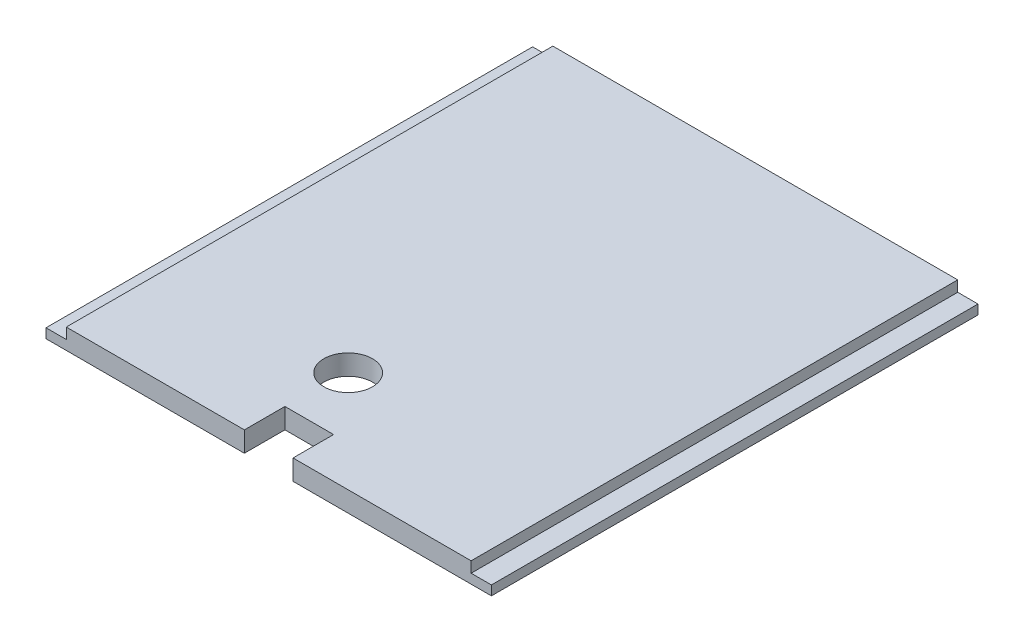
ISO-10303-21;
HEADER;
FILE_DESCRIPTION(('STEP AP214'),'2;1');
FILE_NAME('part.step','',(''),(''),'','','');
FILE_SCHEMA(('AUTOMOTIVE_DESIGN { 1 0 10303 214 1 1 1 1 }'));
ENDSEC;
DATA;
#1=APPLICATION_CONTEXT('core data for automotive mechanical design processes');
#2=APPLICATION_PROTOCOL_DEFINITION('international standard','automotive_design',2000,#1);
#3=PRODUCT_CONTEXT('',#1,'mechanical');
#4=PRODUCT('Part','Part','',(#3));
#5=PRODUCT_RELATED_PRODUCT_CATEGORY('part','',(#4));
#6=PRODUCT_DEFINITION_FORMATION('','',#4);
#7=PRODUCT_DEFINITION_CONTEXT('part definition',#1,'design');
#8=PRODUCT_DEFINITION('design','',#6,#7);
#9=PRODUCT_DEFINITION_SHAPE('','',#8);
#10=(LENGTH_UNIT() NAMED_UNIT(*) SI_UNIT(.MILLI.,.METRE.));
#11=(NAMED_UNIT(*) PLANE_ANGLE_UNIT() SI_UNIT($,.RADIAN.));
#12=(NAMED_UNIT(*) SI_UNIT($,.STERADIAN.) SOLID_ANGLE_UNIT());
#13=UNCERTAINTY_MEASURE_WITH_UNIT(LENGTH_MEASURE(1.E-05),#10,'distance_accuracy_value','');
#14=(GEOMETRIC_REPRESENTATION_CONTEXT(3) GLOBAL_UNCERTAINTY_ASSIGNED_CONTEXT((#13)) GLOBAL_UNIT_ASSIGNED_CONTEXT((#10,
#11,#12)) REPRESENTATION_CONTEXT('',''));
#15=CARTESIAN_POINT('',(0.,0.,0.));
#16=DIRECTION('',(0.,0.,1.));
#17=DIRECTION('',(1.,0.,0.));
#18=AXIS2_PLACEMENT_3D('',#15,#16,#17);
#19=CARTESIAN_POINT('',(0.,6.35,0.));
#20=DIRECTION('',(0.,0.,-1.));
#21=DIRECTION('',(-1.,0.,0.));
#22=AXIS2_PLACEMENT_3D('',#19,#20,#21);
#23=PLANE('',#22);
#24=DIRECTION('',(1.,0.,0.));
#25=VECTOR('',#24,1.);
#26=CARTESIAN_POINT('',(0.,0.,0.));
#27=LINE('',#26,#25);
#28=CARTESIAN_POINT('',(0.,0.,0.));
#29=VERTEX_POINT('',#28);
#30=CARTESIAN_POINT('',(62.13,0.,0.));
#31=VERTEX_POINT('',#30);
#32=EDGE_CURVE('E141',#29,#31,#27,.T.);
#33=ORIENTED_EDGE('',*,*,#32,.T.);
#34=DIRECTION('',(0.,1.,0.));
#35=VECTOR('',#34,1.);
#36=CARTESIAN_POINT('',(62.13,0.,0.));
#37=LINE('',#36,#35);
#38=CARTESIAN_POINT('',(62.13,6.35,0.));
#39=VERTEX_POINT('',#38);
#40=EDGE_CURVE('E124',#31,#39,#37,.T.);
#41=ORIENTED_EDGE('',*,*,#40,.T.);
#42=DIRECTION('',(1.,0.,0.));
#43=VECTOR('',#42,1.);
#44=CARTESIAN_POINT('',(0.,6.35,0.));
#45=LINE('',#44,#43);
#46=CARTESIAN_POINT('',(6.35000000000002,6.35,0.));
#47=VERTEX_POINT('',#46);
#48=EDGE_CURVE('E204',#47,#39,#45,.T.);
#49=ORIENTED_EDGE('',*,*,#48,.F.);
#50=DIRECTION('',(0.,1.,0.));
#51=VECTOR('',#50,1.);
#52=CARTESIAN_POINT('',(6.35000000000002,2.975,0.));
#53=LINE('',#52,#51);
#54=CARTESIAN_POINT('',(6.35000000000002,2.975,0.));
#55=VERTEX_POINT('',#54);
#56=EDGE_CURVE('E214',#55,#47,#53,.T.);
#57=ORIENTED_EDGE('',*,*,#56,.F.);
#58=DIRECTION('',(1.,0.,0.));
#59=VECTOR('',#58,1.);
#60=CARTESIAN_POINT('',(0.,2.975,0.));
#61=LINE('',#60,#59);
#62=CARTESIAN_POINT('',(0.,2.975,0.));
#63=VERTEX_POINT('',#62);
#64=EDGE_CURVE('E222',#63,#55,#61,.T.);
#65=ORIENTED_EDGE('',*,*,#64,.F.);
#66=DIRECTION('',(0.,-1.,0.));
#67=VECTOR('',#66,1.);
#68=CARTESIAN_POINT('',(0.,6.35,0.));
#69=LINE('',#68,#67);
#70=EDGE_CURVE('E11',#63,#29,#69,.T.);
#71=ORIENTED_EDGE('',*,*,#70,.T.);
#72=EDGE_LOOP('',(#33,#41,#49,#57,#65,#71));
#73=FACE_BOUND('',#72,.T.);
#74=ADVANCED_FACE('F35',(#73),#23,.F.);
#75=CARTESIAN_POINT('',(0.,6.35,0.));
#76=DIRECTION('',(1.,0.,0.));
#77=DIRECTION('',(0.,0.,-1.));
#78=AXIS2_PLACEMENT_3D('',#75,#76,#77);
#79=PLANE('',#78);
#80=DIRECTION('',(0.,0.,1.));
#81=VECTOR('',#80,1.);
#82=CARTESIAN_POINT('',(0.,2.975,-152.4));
#83=LINE('',#82,#81);
#84=CARTESIAN_POINT('',(0.,2.975,-152.4));
#85=VERTEX_POINT('',#84);
#86=EDGE_CURVE('E218',#85,#63,#83,.T.);
#87=ORIENTED_EDGE('',*,*,#86,.F.);
#88=DIRECTION('',(0.,-1.,0.));
#89=VECTOR('',#88,1.);
#90=CARTESIAN_POINT('',(0.,6.35,-152.4));
#91=LINE('',#90,#89);
#92=CARTESIAN_POINT('',(0.,0.,-152.4));
#93=VERTEX_POINT('',#92);
#94=EDGE_CURVE('E162',#85,#93,#91,.T.);
#95=ORIENTED_EDGE('',*,*,#94,.T.);
#96=DIRECTION('',(0.,0.,1.));
#97=VECTOR('',#96,1.);
#98=CARTESIAN_POINT('',(0.,0.,0.));
#99=LINE('',#98,#97);
#100=EDGE_CURVE('E155',#93,#29,#99,.T.);
#101=ORIENTED_EDGE('',*,*,#100,.T.);
#102=ORIENTED_EDGE('',*,*,#70,.F.);
#103=EDGE_LOOP('',(#87,#95,#101,#102));
#104=FACE_BOUND('',#103,.T.);
#105=ADVANCED_FACE('F37',(#104),#79,.F.);
#106=CARTESIAN_POINT('',(77.37,6.35,0.));
#107=VERTEX_POINT('',#106);
#108=CARTESIAN_POINT('',(133.15,6.35,0.));
#109=VERTEX_POINT('',#108);
#110=EDGE_CURVE('E161',#107,#109,#45,.T.);
#111=ORIENTED_EDGE('',*,*,#110,.F.);
#112=DIRECTION('',(0.,1.,0.));
#113=VECTOR('',#112,1.);
#114=CARTESIAN_POINT('',(77.37,0.,0.));
#115=LINE('',#114,#113);
#116=CARTESIAN_POINT('',(77.37,0.,0.));
#117=VERTEX_POINT('',#116);
#118=EDGE_CURVE('E134',#117,#107,#115,.T.);
#119=ORIENTED_EDGE('',*,*,#118,.F.);
#120=CARTESIAN_POINT('',(139.5,0.,0.));
#121=VERTEX_POINT('',#120);
#122=EDGE_CURVE('E150',#117,#121,#27,.T.);
#123=ORIENTED_EDGE('',*,*,#122,.T.);
#124=DIRECTION('',(0.,-1.,0.));
#125=VECTOR('',#124,1.);
#126=CARTESIAN_POINT('',(139.5,6.35,0.));
#127=LINE('',#126,#125);
#128=CARTESIAN_POINT('',(139.5,2.975,0.));
#129=VERTEX_POINT('',#128);
#130=EDGE_CURVE('E43',#129,#121,#127,.T.);
#131=ORIENTED_EDGE('',*,*,#130,.F.);
#132=DIRECTION('',(1.,0.,0.));
#133=VECTOR('',#132,1.);
#134=CARTESIAN_POINT('',(139.5,2.975,0.));
#135=LINE('',#134,#133);
#136=CARTESIAN_POINT('',(133.15,2.975,0.));
#137=VERTEX_POINT('',#136);
#138=EDGE_CURVE('E190',#137,#129,#135,.T.);
#139=ORIENTED_EDGE('',*,*,#138,.F.);
#140=DIRECTION('',(0.,1.,0.));
#141=VECTOR('',#140,1.);
#142=CARTESIAN_POINT('',(133.15,2.975,0.));
#143=LINE('',#142,#141);
#144=EDGE_CURVE('E199',#137,#109,#143,.T.);
#145=ORIENTED_EDGE('',*,*,#144,.T.);
#146=EDGE_LOOP('',(#111,#119,#123,#131,#139,#145));
#147=FACE_BOUND('',#146,.T.);
#148=ADVANCED_FACE('F248',(#147),#23,.F.);
#149=CARTESIAN_POINT('',(139.5,6.35,0.));
#150=DIRECTION('',(-1.,0.,0.));
#151=DIRECTION('',(0.,0.,1.));
#152=AXIS2_PLACEMENT_3D('',#149,#150,#151);
#153=PLANE('',#152);
#154=DIRECTION('',(0.,-1.,0.));
#155=VECTOR('',#154,1.);
#156=CARTESIAN_POINT('',(139.5,6.35,-152.4));
#157=LINE('',#156,#155);
#158=CARTESIAN_POINT('',(139.5,2.975,-152.4));
#159=VERTEX_POINT('',#158);
#160=CARTESIAN_POINT('',(139.5,0.,-152.4));
#161=VERTEX_POINT('',#160);
#162=EDGE_CURVE('E164',#159,#161,#157,.T.);
#163=ORIENTED_EDGE('',*,*,#162,.F.);
#164=DIRECTION('',(0.,0.,-1.));
#165=VECTOR('',#164,1.);
#166=CARTESIAN_POINT('',(139.5,2.975,-152.4));
#167=LINE('',#166,#165);
#168=EDGE_CURVE('E174',#129,#159,#167,.T.);
#169=ORIENTED_EDGE('',*,*,#168,.F.);
#170=ORIENTED_EDGE('',*,*,#130,.T.);
#171=DIRECTION('',(0.,0.,-1.));
#172=VECTOR('',#171,1.);
#173=CARTESIAN_POINT('',(139.5,0.,0.));
#174=LINE('',#173,#172);
#175=EDGE_CURVE('E149',#121,#161,#174,.T.);
#176=ORIENTED_EDGE('',*,*,#175,.T.);
#177=EDGE_LOOP('',(#163,#169,#170,#176));
#178=FACE_BOUND('',#177,.T.);
#179=ADVANCED_FACE('F172',(#178),#153,.F.);
#180=CARTESIAN_POINT('',(0.,6.35,-152.4));
#181=DIRECTION('',(0.,0.,1.));
#182=DIRECTION('',(1.,0.,0.));
#183=AXIS2_PLACEMENT_3D('',#180,#181,#182);
#184=PLANE('',#183);
#185=DIRECTION('',(-1.,0.,0.));
#186=VECTOR('',#185,1.);
#187=CARTESIAN_POINT('',(0.,2.975,-152.4));
#188=LINE('',#187,#186);
#189=CARTESIAN_POINT('',(6.35,2.975,-152.4));
#190=VERTEX_POINT('',#189);
#191=EDGE_CURVE('E211',#190,#85,#188,.T.);
#192=ORIENTED_EDGE('',*,*,#191,.F.);
#193=DIRECTION('',(0.,1.,0.));
#194=VECTOR('',#193,1.);
#195=CARTESIAN_POINT('',(6.35,2.975,-152.4));
#196=LINE('',#195,#194);
#197=CARTESIAN_POINT('',(6.35,6.35,-152.4));
#198=VERTEX_POINT('',#197);
#199=EDGE_CURVE('E210',#190,#198,#196,.T.);
#200=ORIENTED_EDGE('',*,*,#199,.T.);
#201=DIRECTION('',(-1.,0.,0.));
#202=VECTOR('',#201,1.);
#203=CARTESIAN_POINT('',(0.,6.35,-152.4));
#204=LINE('',#203,#202);
#205=CARTESIAN_POINT('',(133.15,6.35,-152.4));
#206=VERTEX_POINT('',#205);
#207=EDGE_CURVE('E165',#206,#198,#204,.T.);
#208=ORIENTED_EDGE('',*,*,#207,.F.);
#209=DIRECTION('',(0.,1.,0.));
#210=VECTOR('',#209,1.);
#211=CARTESIAN_POINT('',(133.15,2.975,-152.4));
#212=LINE('',#211,#210);
#213=CARTESIAN_POINT('',(133.15,2.975,-152.4));
#214=VERTEX_POINT('',#213);
#215=EDGE_CURVE('E58',#214,#206,#212,.T.);
#216=ORIENTED_EDGE('',*,*,#215,.F.);
#217=DIRECTION('',(-1.,0.,0.));
#218=VECTOR('',#217,1.);
#219=CARTESIAN_POINT('',(139.5,2.975,-152.4));
#220=LINE('',#219,#218);
#221=EDGE_CURVE('E184',#159,#214,#220,.T.);
#222=ORIENTED_EDGE('',*,*,#221,.F.);
#223=ORIENTED_EDGE('',*,*,#162,.T.);
#224=DIRECTION('',(-1.,0.,0.));
#225=VECTOR('',#224,1.);
#226=CARTESIAN_POINT('',(0.,0.,-152.4));
#227=LINE('',#226,#225);
#228=EDGE_CURVE('E153',#161,#93,#227,.T.);
#229=ORIENTED_EDGE('',*,*,#228,.T.);
#230=ORIENTED_EDGE('',*,*,#94,.F.);
#231=EDGE_LOOP('',(#192,#200,#208,#216,#222,#223,#229,#230));
#232=FACE_BOUND('',#231,.T.);
#233=ADVANCED_FACE('F181',(#232),#184,.F.);
#234=CARTESIAN_POINT('',(0.,6.35,0.));
#235=DIRECTION('',(0.,-1.,0.));
#236=DIRECTION('',(0.,0.,-1.));
#237=AXIS2_PLACEMENT_3D('',#234,#235,#236);
#238=PLANE('',#237);
#239=CARTESIAN_POINT('',(62.892,6.35,-31.75));
#240=DIRECTION('',(0.,1.,0.));
#241=DIRECTION('',(0.,0.,1.));
#242=AXIS2_PLACEMENT_3D('',#239,#240,#241);
#243=CIRCLE('',#242,7.62);
#244=CARTESIAN_POINT('',(62.892,6.35,-24.13));
#245=VERTEX_POINT('',#244);
#246=EDGE_CURVE('E226',#245,#245,#243,.T.);
#247=ORIENTED_EDGE('',*,*,#246,.F.);
#248=EDGE_LOOP('',(#247));
#249=FACE_BOUND('',#248,.T.);
#250=ORIENTED_EDGE('',*,*,#48,.T.);
#251=DIRECTION('',(0.,0.,1.));
#252=VECTOR('',#251,1.);
#253=CARTESIAN_POINT('',(62.13,6.35,0.));
#254=LINE('',#253,#252);
#255=CARTESIAN_POINT('',(62.13,6.35,-12.7));
#256=VERTEX_POINT('',#255);
#257=EDGE_CURVE('E129',#256,#39,#254,.T.);
#258=ORIENTED_EDGE('',*,*,#257,.F.);
#259=DIRECTION('',(-1.,0.,0.));
#260=VECTOR('',#259,1.);
#261=CARTESIAN_POINT('',(62.13,6.35,-12.7));
#262=LINE('',#261,#260);
#263=CARTESIAN_POINT('',(77.37,6.35,-12.7));
#264=VERTEX_POINT('',#263);
#265=EDGE_CURVE('E145',#264,#256,#262,.T.);
#266=ORIENTED_EDGE('',*,*,#265,.F.);
#267=DIRECTION('',(0.,0.,-1.));
#268=VECTOR('',#267,1.);
#269=CARTESIAN_POINT('',(77.37,6.35,0.));
#270=LINE('',#269,#268);
#271=EDGE_CURVE('E238',#107,#264,#270,.T.);
#272=ORIENTED_EDGE('',*,*,#271,.F.);
#273=ORIENTED_EDGE('',*,*,#110,.T.);
#274=DIRECTION('',(0.,0.,1.));
#275=VECTOR('',#274,1.);
#276=CARTESIAN_POINT('',(133.15,6.35,-152.4));
#277=LINE('',#276,#275);
#278=EDGE_CURVE('E192',#206,#109,#277,.T.);
#279=ORIENTED_EDGE('',*,*,#278,.F.);
#280=ORIENTED_EDGE('',*,*,#207,.T.);
#281=DIRECTION('',(0.,0.,-1.));
#282=VECTOR('',#281,1.);
#283=CARTESIAN_POINT('',(6.35,6.35,-152.4));
#284=LINE('',#283,#282);
#285=EDGE_CURVE('E202',#47,#198,#284,.T.);
#286=ORIENTED_EDGE('',*,*,#285,.F.);
#287=EDGE_LOOP('',(#250,#258,#266,#272,#273,#279,#280,#286));
#288=FACE_BOUND('',#287,.T.);
#289=ADVANCED_FACE('F208',(#249,#288),#238,.F.);
#290=CARTESIAN_POINT('',(0.,0.,0.));
#291=DIRECTION('',(0.,-1.,0.));
#292=DIRECTION('',(0.,0.,-1.));
#293=AXIS2_PLACEMENT_3D('',#290,#291,#292);
#294=PLANE('',#293);
#295=DIRECTION('',(0.,0.,1.));
#296=VECTOR('',#295,1.);
#297=CARTESIAN_POINT('',(62.13,0.,0.));
#298=LINE('',#297,#296);
#299=CARTESIAN_POINT('',(62.13,0.,-12.7));
#300=VERTEX_POINT('',#299);
#301=EDGE_CURVE('E127',#300,#31,#298,.T.);
#302=ORIENTED_EDGE('',*,*,#301,.T.);
#303=ORIENTED_EDGE('',*,*,#32,.F.);
#304=ORIENTED_EDGE('',*,*,#100,.F.);
#305=ORIENTED_EDGE('',*,*,#228,.F.);
#306=ORIENTED_EDGE('',*,*,#175,.F.);
#307=ORIENTED_EDGE('',*,*,#122,.F.);
#308=DIRECTION('',(0.,0.,-1.));
#309=VECTOR('',#308,1.);
#310=CARTESIAN_POINT('',(77.37,0.,0.));
#311=LINE('',#310,#309);
#312=CARTESIAN_POINT('',(77.37,0.,-12.7));
#313=VERTEX_POINT('',#312);
#314=EDGE_CURVE('E144',#117,#313,#311,.T.);
#315=ORIENTED_EDGE('',*,*,#314,.T.);
#316=DIRECTION('',(-1.,0.,0.));
#317=VECTOR('',#316,1.);
#318=CARTESIAN_POINT('',(62.13,0.,-12.7));
#319=LINE('',#318,#317);
#320=EDGE_CURVE('E50',#313,#300,#319,.T.);
#321=ORIENTED_EDGE('',*,*,#320,.T.);
#322=EDGE_LOOP('',(#302,#303,#304,#305,#306,#307,#315,#321));
#323=FACE_BOUND('',#322,.T.);
#324=CARTESIAN_POINT('',(62.892,0.,-31.75));
#325=DIRECTION('',(0.,1.,0.));
#326=DIRECTION('',(0.,0.,1.));
#327=AXIS2_PLACEMENT_3D('',#324,#325,#326);
#328=CIRCLE('',#327,7.62);
#329=CARTESIAN_POINT('',(62.892,0.,-24.13));
#330=VERTEX_POINT('',#329);
#331=EDGE_CURVE('E229',#330,#330,#328,.T.);
#332=ORIENTED_EDGE('',*,*,#331,.T.);
#333=EDGE_LOOP('',(#332));
#334=FACE_BOUND('',#333,.T.);
#335=ADVANCED_FACE('F138',(#323,#334),#294,.T.);
#336=CARTESIAN_POINT('',(133.15,2.975,-152.4));
#337=DIRECTION('',(-1.,0.,0.));
#338=DIRECTION('',(0.,0.,1.));
#339=AXIS2_PLACEMENT_3D('',#336,#337,#338);
#340=PLANE('',#339);
#341=ORIENTED_EDGE('',*,*,#278,.T.);
#342=ORIENTED_EDGE('',*,*,#144,.F.);
#343=DIRECTION('',(0.,0.,1.));
#344=VECTOR('',#343,1.);
#345=CARTESIAN_POINT('',(133.15,2.975,-152.4));
#346=LINE('',#345,#344);
#347=EDGE_CURVE('E188',#214,#137,#346,.T.);
#348=ORIENTED_EDGE('',*,*,#347,.F.);
#349=ORIENTED_EDGE('',*,*,#215,.T.);
#350=EDGE_LOOP('',(#341,#342,#348,#349));
#351=FACE_BOUND('',#350,.T.);
#352=ADVANCED_FACE('F250',(#351),#340,.F.);
#353=CARTESIAN_POINT('',(0.,2.975,0.));
#354=DIRECTION('',(0.,-1.,0.));
#355=DIRECTION('',(0.,0.,-1.));
#356=AXIS2_PLACEMENT_3D('',#353,#354,#355);
#357=PLANE('',#356);
#358=ORIENTED_EDGE('',*,*,#168,.T.);
#359=ORIENTED_EDGE('',*,*,#221,.T.);
#360=ORIENTED_EDGE('',*,*,#347,.T.);
#361=ORIENTED_EDGE('',*,*,#138,.T.);
#362=EDGE_LOOP('',(#358,#359,#360,#361));
#363=FACE_BOUND('',#362,.T.);
#364=ADVANCED_FACE('F251',(#363),#357,.F.);
#365=CARTESIAN_POINT('',(6.35,2.975,-152.4));
#366=DIRECTION('',(1.,0.,0.));
#367=DIRECTION('',(0.,0.,-1.));
#368=AXIS2_PLACEMENT_3D('',#365,#366,#367);
#369=PLANE('',#368);
#370=ORIENTED_EDGE('',*,*,#285,.T.);
#371=ORIENTED_EDGE('',*,*,#199,.F.);
#372=DIRECTION('',(0.,0.,-1.));
#373=VECTOR('',#372,1.);
#374=CARTESIAN_POINT('',(6.35,2.975,-152.4));
#375=LINE('',#374,#373);
#376=EDGE_CURVE('E220',#55,#190,#375,.T.);
#377=ORIENTED_EDGE('',*,*,#376,.F.);
#378=ORIENTED_EDGE('',*,*,#56,.T.);
#379=EDGE_LOOP('',(#370,#371,#377,#378));
#380=FACE_BOUND('',#379,.T.);
#381=ADVANCED_FACE('F253',(#380),#369,.F.);
#382=CARTESIAN_POINT('',(0.,2.975,0.));
#383=DIRECTION('',(0.,1.,0.));
#384=DIRECTION('',(0.,0.,1.));
#385=AXIS2_PLACEMENT_3D('',#382,#383,#384);
#386=PLANE('',#385);
#387=ORIENTED_EDGE('',*,*,#86,.T.);
#388=ORIENTED_EDGE('',*,*,#64,.T.);
#389=ORIENTED_EDGE('',*,*,#376,.T.);
#390=ORIENTED_EDGE('',*,*,#191,.T.);
#391=EDGE_LOOP('',(#387,#388,#389,#390));
#392=FACE_BOUND('',#391,.T.);
#393=ADVANCED_FACE('F259',(#392),#386,.T.);
#394=CARTESIAN_POINT('',(62.892,0.,-31.75));
#395=DIRECTION('',(0.,1.,0.));
#396=DIRECTION('',(0.,0.,1.));
#397=AXIS2_PLACEMENT_3D('',#394,#395,#396);
#398=CYLINDRICAL_SURFACE('',#397,7.62);
#399=ORIENTED_EDGE('',*,*,#331,.F.);
#400=EDGE_LOOP('',(#399));
#401=FACE_BOUND('',#400,.T.);
#402=ORIENTED_EDGE('',*,*,#246,.T.);
#403=EDGE_LOOP('',(#402));
#404=FACE_BOUND('',#403,.T.);
#405=ADVANCED_FACE('F286',(#401,#404),#398,.F.);
#406=CARTESIAN_POINT('',(62.13,0.,0.));
#407=DIRECTION('',(-1.,0.,0.));
#408=DIRECTION('',(0.,0.,1.));
#409=AXIS2_PLACEMENT_3D('',#406,#407,#408);
#410=PLANE('',#409);
#411=ORIENTED_EDGE('',*,*,#257,.T.);
#412=ORIENTED_EDGE('',*,*,#40,.F.);
#413=ORIENTED_EDGE('',*,*,#301,.F.);
#414=DIRECTION('',(0.,1.,0.));
#415=VECTOR('',#414,1.);
#416=CARTESIAN_POINT('',(62.13,0.,-12.7));
#417=LINE('',#416,#415);
#418=EDGE_CURVE('E198',#300,#256,#417,.T.);
#419=ORIENTED_EDGE('',*,*,#418,.T.);
#420=EDGE_LOOP('',(#411,#412,#413,#419));
#421=FACE_BOUND('',#420,.T.);
#422=ADVANCED_FACE('F126',(#421),#410,.F.);
#423=CARTESIAN_POINT('',(62.13,0.,-12.7));
#424=DIRECTION('',(0.,0.,-1.));
#425=DIRECTION('',(-1.,0.,0.));
#426=AXIS2_PLACEMENT_3D('',#423,#424,#425);
#427=PLANE('',#426);
#428=ORIENTED_EDGE('',*,*,#265,.T.);
#429=ORIENTED_EDGE('',*,*,#418,.F.);
#430=ORIENTED_EDGE('',*,*,#320,.F.);
#431=DIRECTION('',(0.,1.,0.));
#432=VECTOR('',#431,1.);
#433=CARTESIAN_POINT('',(77.37,0.,-12.7));
#434=LINE('',#433,#432);
#435=EDGE_CURVE('E233',#313,#264,#434,.T.);
#436=ORIENTED_EDGE('',*,*,#435,.T.);
#437=EDGE_LOOP('',(#428,#429,#430,#436));
#438=FACE_BOUND('',#437,.T.);
#439=ADVANCED_FACE('F294',(#438),#427,.F.);
#440=CARTESIAN_POINT('',(77.37,0.,0.));
#441=DIRECTION('',(1.,0.,0.));
#442=DIRECTION('',(0.,0.,-1.));
#443=AXIS2_PLACEMENT_3D('',#440,#441,#442);
#444=PLANE('',#443);
#445=ORIENTED_EDGE('',*,*,#271,.T.);
#446=ORIENTED_EDGE('',*,*,#435,.F.);
#447=ORIENTED_EDGE('',*,*,#314,.F.);
#448=ORIENTED_EDGE('',*,*,#118,.T.);
#449=EDGE_LOOP('',(#445,#446,#447,#448));
#450=FACE_BOUND('',#449,.T.);
#451=ADVANCED_FACE('F245',(#450),#444,.F.);
#452=CLOSED_SHELL('',(#74,#105,#148,#179,#233,#289,#335,#352,#364,#381,#393,#405,#422,#439,#451));
#453=MANIFOLD_SOLID_BREP('B2',#452);
#454=ADVANCED_BREP_SHAPE_REPRESENTATION('',(#18,#453),#14);
#455=SHAPE_DEFINITION_REPRESENTATION(#9,#454);
ENDSEC;
END-ISO-10303-21;
